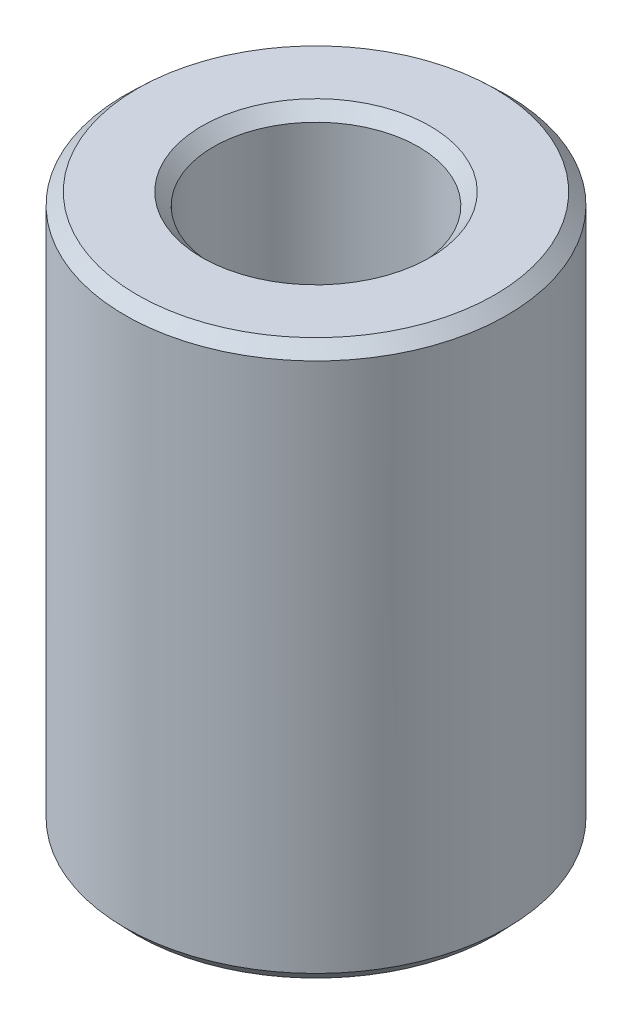
ISO-10303-21;
HEADER;
FILE_DESCRIPTION(('STEP AP214'),'2;1');
FILE_NAME('part.step','',(''),(''),'','','');
FILE_SCHEMA(('AUTOMOTIVE_DESIGN { 1 0 10303 214 1 1 1 1 }'));
ENDSEC;
DATA;
#1=APPLICATION_CONTEXT('core data for automotive mechanical design processes');
#2=APPLICATION_PROTOCOL_DEFINITION('international standard','automotive_design',2000,#1);
#3=PRODUCT_CONTEXT('',#1,'mechanical');
#4=PRODUCT('Part','Part','',(#3));
#5=PRODUCT_RELATED_PRODUCT_CATEGORY('part','',(#4));
#6=PRODUCT_DEFINITION_FORMATION('','',#4);
#7=PRODUCT_DEFINITION_CONTEXT('part definition',#1,'design');
#8=PRODUCT_DEFINITION('design','',#6,#7);
#9=PRODUCT_DEFINITION_SHAPE('','',#8);
#10=(LENGTH_UNIT() NAMED_UNIT(*) SI_UNIT(.MILLI.,.METRE.));
#11=(NAMED_UNIT(*) PLANE_ANGLE_UNIT() SI_UNIT($,.RADIAN.));
#12=(NAMED_UNIT(*) SI_UNIT($,.STERADIAN.) SOLID_ANGLE_UNIT());
#13=UNCERTAINTY_MEASURE_WITH_UNIT(LENGTH_MEASURE(1.E-05),#10,'distance_accuracy_value','');
#14=(GEOMETRIC_REPRESENTATION_CONTEXT(3) GLOBAL_UNCERTAINTY_ASSIGNED_CONTEXT((#13)) GLOBAL_UNIT_ASSIGNED_CONTEXT((#10,
#11,#12)) REPRESENTATION_CONTEXT('',''));
#15=CARTESIAN_POINT('',(0.,0.,0.));
#16=DIRECTION('',(0.,0.,1.));
#17=DIRECTION('',(1.,0.,0.));
#18=AXIS2_PLACEMENT_3D('',#15,#16,#17);
#19=CARTESIAN_POINT('',(0.,159.677422281594,0.));
#20=DIRECTION('',(0.,-1.,0.));
#21=DIRECTION('',(0.,0.,-1.));
#22=AXIS2_PLACEMENT_3D('',#19,#20,#21);
#23=CYLINDRICAL_SURFACE('',#22,55.);
#24=CARTESIAN_POINT('',(0.,3.51561170593054,0.));
#25=DIRECTION('',(0.,1.,0.));
#26=DIRECTION('',(0.,0.,1.));
#27=AXIS2_PLACEMENT_3D('',#24,#25,#26);
#28=CIRCLE('',#27,55.);
#29=CARTESIAN_POINT('',(0.,3.51561170593051,-55.));
#30=VERTEX_POINT('',#29);
#31=EDGE_CURVE('E10',#30,#30,#28,.T.);
#32=CARTESIAN_POINT('',(0.,156.344441713557,0.));
#33=DIRECTION('',(0.,1.,0.));
#34=DIRECTION('',(0.,0.,1.));
#35=AXIS2_PLACEMENT_3D('',#32,#33,#34);
#36=CIRCLE('',#35,55.);
#37=CARTESIAN_POINT('',(0.,156.344441713557,-55.));
#38=VERTEX_POINT('',#37);
#39=EDGE_CURVE('E50',#38,#38,#36,.F.);
#40=CARTESIAN_POINT('',(0.,3.51561170593051,-55.));
#41=CARTESIAN_POINT('',(0.,5.10757868517662,-55.));
#42=CARTESIAN_POINT('',(0.,6.69954566442273,-55.));
#43=CARTESIAN_POINT('',(0.,9.88347962291494,-55.));
#44=CARTESIAN_POINT('',(0.,11.475446602161,-55.));
#45=CARTESIAN_POINT('',(0.,14.6593805606533,-55.));
#46=CARTESIAN_POINT('',(0.,16.2513475398994,-55.));
#47=CARTESIAN_POINT('',(0.,19.4352814983916,-55.));
#48=CARTESIAN_POINT('',(0.,21.0272484776377,-55.));
#49=CARTESIAN_POINT('',(0.,24.2111824361299,-55.));
#50=CARTESIAN_POINT('',(0.,25.803149415376,-55.));
#51=CARTESIAN_POINT('',(0.,28.9870833738682,-55.));
#52=CARTESIAN_POINT('',(0.,30.5790503531143,-55.));
#53=CARTESIAN_POINT('',(0.,33.7629843116065,-55.));
#54=CARTESIAN_POINT('',(0.,35.3549512908526,-55.));
#55=CARTESIAN_POINT('',(0.,38.5388852493449,-55.));
#56=CARTESIAN_POINT('',(0.,40.130852228591,-55.));
#57=CARTESIAN_POINT('',(0.,43.3147861870832,-55.));
#58=CARTESIAN_POINT('',(0.,44.9067531663293,-55.));
#59=CARTESIAN_POINT('',(0.,48.0906871248215,-55.));
#60=CARTESIAN_POINT('',(0.,49.6826541040676,-55.));
#61=CARTESIAN_POINT('',(0.,52.8665880625598,-55.));
#62=CARTESIAN_POINT('',(0.,54.4585550418059,-55.));
#63=CARTESIAN_POINT('',(0.,57.6424890002981,-55.));
#64=CARTESIAN_POINT('',(0.,59.2344559795442,-55.));
#65=CARTESIAN_POINT('',(0.,62.4183899380365,-55.));
#66=CARTESIAN_POINT('',(0.,64.0103569172826,-55.));
#67=CARTESIAN_POINT('',(0.,67.1942908757748,-55.));
#68=CARTESIAN_POINT('',(0.,68.7862578550209,-55.));
#69=CARTESIAN_POINT('',(0.,71.9701918135131,-55.));
#70=CARTESIAN_POINT('',(0.,73.5621587927592,-55.));
#71=CARTESIAN_POINT('',(0.,76.7460927512514,-55.));
#72=CARTESIAN_POINT('',(0.,78.3380597304975,-55.));
#73=CARTESIAN_POINT('',(0.,81.5219936889897,-55.));
#74=CARTESIAN_POINT('',(0.,83.1139606682358,-55.));
#75=CARTESIAN_POINT('',(0.,86.297894626728,-55.));
#76=CARTESIAN_POINT('',(0.,87.8898616059742,-55.));
#77=CARTESIAN_POINT('',(0.,91.0737955644664,-55.));
#78=CARTESIAN_POINT('',(0.,92.6657625437125,-55.));
#79=CARTESIAN_POINT('',(0.,95.8496965022047,-55.));
#80=CARTESIAN_POINT('',(0.,97.4416634814508,-55.));
#81=CARTESIAN_POINT('',(0.,100.625597439943,-55.));
#82=CARTESIAN_POINT('',(0.,102.217564419189,-55.));
#83=CARTESIAN_POINT('',(0.,105.401498377681,-55.));
#84=CARTESIAN_POINT('',(0.,106.993465356927,-55.));
#85=CARTESIAN_POINT('',(0.,110.17739931542,-55.));
#86=CARTESIAN_POINT('',(0.,111.769366294666,-55.));
#87=CARTESIAN_POINT('',(0.,114.953300253158,-55.));
#88=CARTESIAN_POINT('',(0.,116.545267232404,-55.));
#89=CARTESIAN_POINT('',(0.,119.729201190896,-55.));
#90=CARTESIAN_POINT('',(0.,121.321168170142,-55.));
#91=CARTESIAN_POINT('',(0.,124.505102128635,-55.));
#92=CARTESIAN_POINT('',(0.,126.097069107881,-55.));
#93=CARTESIAN_POINT('',(0.,129.281003066373,-55.));
#94=CARTESIAN_POINT('',(0.,130.872970045619,-55.));
#95=CARTESIAN_POINT('',(0.,134.056904004111,-55.));
#96=CARTESIAN_POINT('',(0.,135.648870983357,-55.));
#97=CARTESIAN_POINT('',(0.,138.83280494185,-55.));
#98=CARTESIAN_POINT('',(0.,140.424771921096,-55.));
#99=CARTESIAN_POINT('',(0.,143.608705879588,-55.));
#100=CARTESIAN_POINT('',(0.,145.200672858834,-55.));
#101=CARTESIAN_POINT('',(0.,148.384606817326,-55.));
#102=CARTESIAN_POINT('',(0.,149.976573796572,-55.));
#103=CARTESIAN_POINT('',(0.,153.160507755065,-55.));
#104=CARTESIAN_POINT('',(0.,154.752474734311,-55.));
#105=CARTESIAN_POINT('',(0.,156.344441713557,-55.));
#106=B_SPLINE_CURVE_WITH_KNOTS('',3,(#40,#41,#42,#43,#44,#45,#46,#47,#48,#49,#50,#51,#52,#53,
#54,#55,#56,#57,#58,#59,#60,#61,#62,#63,#64,#65,#66,#67,#68,#69,#70,#71,#72,#73,#74,#75,#76,#77,
#78,#79,#80,#81,#82,#83,#84,#85,#86,#87,#88,#89,#90,#91,#92,#93,#94,#95,#96,#97,#98,#99,#100,
#101,#102,#103,#104,#105),.UNSPECIFIED.,.F.,.F.,(4,2,2,2,2,2,2,2,2,2,2,2,2,2,2,2,2,2,2,2,2,2,2,
2,2,2,2,2,2,2,2,2,4),(0.,4.77590093773833,9.55180187547663,14.327702813215,19.1036037509533,
23.8795046886916,28.6554056264299,33.4313065641682,38.2072075019066,42.9831084396449,
47.7590093773832,52.5349103151215,57.3108112528598,62.0867121905981,66.8626131283365,
71.6385140660748,76.4144150038131,81.1903159415514,85.9662168792897,90.7421178170281,
95.5180187547664,100.293919692505,105.069820630243,109.845721567981,114.62162250572,
119.397523443458,124.173424381196,128.949325318935,133.725226256673,138.501127194411,
143.27702813215,148.052929069888,152.828830007626),.UNSPECIFIED.);
#107=EDGE_CURVE('BSEAM39',#30,#38,#106,.T.);
#108=ORIENTED_EDGE('',*,*,#31,.T.);
#109=ORIENTED_EDGE('',*,*,#39,.T.);
#110=ORIENTED_EDGE('',*,*,#107,.T.);
#111=ORIENTED_EDGE('',*,*,#107,.F.);
#112=EDGE_LOOP('',(#108,#110,#109,#111));
#113=FACE_BOUND('',#112,.T.);
#114=ADVANCED_FACE('F39',(#113),#23,.T.);
#115=CARTESIAN_POINT('',(0.,159.677422281594,0.));
#116=DIRECTION('',(0.,1.,0.));
#117=DIRECTION('',(0.,0.,1.));
#118=AXIS2_PLACEMENT_3D('',#115,#116,#117);
#119=PLANE('',#118);
#120=CARTESIAN_POINT('',(0.,159.677422281594,0.));
#121=DIRECTION('',(0.,1.,0.));
#122=DIRECTION('',(0.,0.,1.));
#123=AXIS2_PLACEMENT_3D('',#120,#121,#122);
#124=CIRCLE('',#123,32.8524784510757);
#125=CARTESIAN_POINT('',(0.,159.677422281594,32.8524784510757));
#126=VERTEX_POINT('',#125);
#127=EDGE_CURVE('E58',#126,#126,#124,.F.);
#128=ORIENTED_EDGE('',*,*,#127,.T.);
#129=EDGE_LOOP('',(#128));
#130=FACE_BOUND('',#129,.T.);
#131=CARTESIAN_POINT('',(0.,159.677422281594,0.));
#132=DIRECTION('',(0.,1.,0.));
#133=DIRECTION('',(0.,0.,1.));
#134=AXIS2_PLACEMENT_3D('',#131,#132,#133);
#135=CIRCLE('',#134,51.4843882940697);
#136=CARTESIAN_POINT('',(0.,159.677422281594,-51.4843882940697));
#137=VERTEX_POINT('',#136);
#138=EDGE_CURVE('E61',#137,#137,#135,.T.);
#139=ORIENTED_EDGE('',*,*,#138,.T.);
#140=EDGE_LOOP('',(#139));
#141=FACE_BOUND('',#140,.T.);
#142=ADVANCED_FACE('F88',(#130,#141),#119,.T.);
#143=CARTESIAN_POINT('',(0.,0.,0.));
#144=DIRECTION('',(0.,1.,0.));
#145=DIRECTION('',(0.,0.,1.));
#146=AXIS2_PLACEMENT_3D('',#143,#144,#145);
#147=PLANE('',#146);
#148=CARTESIAN_POINT('',(0.,0.,0.));
#149=DIRECTION('',(0.,1.,0.));
#150=DIRECTION('',(0.,0.,1.));
#151=AXIS2_PLACEMENT_3D('',#148,#149,#150);
#152=CIRCLE('',#151,33.0351095889689);
#153=CARTESIAN_POINT('',(0.,0.,33.0351095889689));
#154=VERTEX_POINT('',#153);
#155=EDGE_CURVE('E51',#154,#154,#152,.T.);
#156=ORIENTED_EDGE('',*,*,#155,.T.);
#157=EDGE_LOOP('',(#156));
#158=FACE_BOUND('',#157,.T.);
#159=CARTESIAN_POINT('',(0.,0.,0.));
#160=DIRECTION('',(0.,1.,0.));
#161=DIRECTION('',(0.,0.,1.));
#162=AXIS2_PLACEMENT_3D('',#159,#160,#161);
#163=CIRCLE('',#162,51.6670194319628);
#164=CARTESIAN_POINT('',(0.,0.,51.6670194319628));
#165=VERTEX_POINT('',#164);
#166=EDGE_CURVE('E54',#165,#165,#163,.F.);
#167=ORIENTED_EDGE('',*,*,#166,.T.);
#168=EDGE_LOOP('',(#167));
#169=FACE_BOUND('',#168,.T.);
#170=ADVANCED_FACE('F83',(#158,#169),#147,.F.);
#171=CARTESIAN_POINT('',(0.,159.677422281594,0.));
#172=DIRECTION('',(0.,-1.,0.));
#173=DIRECTION('',(0.,0.,-1.));
#174=AXIS2_PLACEMENT_3D('',#171,#172,#173);
#175=CYLINDRICAL_SURFACE('',#174,29.5194978830384);
#176=CARTESIAN_POINT('',(0.,156.161810575663,0.));
#177=DIRECTION('',(0.,1.,0.));
#178=DIRECTION('',(0.,0.,1.));
#179=AXIS2_PLACEMENT_3D('',#176,#177,#178);
#180=CIRCLE('',#179,29.5194978830384);
#181=CARTESIAN_POINT('',(0.,156.161810575663,-29.5194978830384));
#182=VERTEX_POINT('',#181);
#183=EDGE_CURVE('E67',#182,#182,#180,.T.);
#184=CARTESIAN_POINT('',(0.,3.33298056803705,0.));
#185=DIRECTION('',(0.,1.,0.));
#186=DIRECTION('',(0.,0.,1.));
#187=AXIS2_PLACEMENT_3D('',#184,#185,#186);
#188=CIRCLE('',#187,29.5194978830384);
#189=CARTESIAN_POINT('',(0.,3.33298056803705,-29.5194978830384));
#190=VERTEX_POINT('',#189);
#191=EDGE_CURVE('E69',#190,#190,#188,.F.);
#192=CARTESIAN_POINT('',(0.,156.161810575663,-29.5194978830384));
#193=CARTESIAN_POINT('',(0.,154.569843596417,-29.5194978830384));
#194=CARTESIAN_POINT('',(0.,152.977876617171,-29.5194978830384));
#195=CARTESIAN_POINT('',(0.,149.793942658679,-29.5194978830384));
#196=CARTESIAN_POINT('',(0.,148.201975679433,-29.5194978830384));
#197=CARTESIAN_POINT('',(0.,145.01804172094,-29.5194978830384));
#198=CARTESIAN_POINT('',(0.,143.426074741694,-29.5194978830384));
#199=CARTESIAN_POINT('',(0.,140.242140783202,-29.5194978830384));
#200=CARTESIAN_POINT('',(0.,138.650173803956,-29.5194978830384));
#201=CARTESIAN_POINT('',(0.,135.466239845464,-29.5194978830384));
#202=CARTESIAN_POINT('',(0.,133.874272866218,-29.5194978830384));
#203=CARTESIAN_POINT('',(0.,130.690338907725,-29.5194978830384));
#204=CARTESIAN_POINT('',(0.,129.098371928479,-29.5194978830384));
#205=CARTESIAN_POINT('',(0.,125.914437969987,-29.5194978830384));
#206=CARTESIAN_POINT('',(0.,124.322470990741,-29.5194978830384));
#207=CARTESIAN_POINT('',(0.,121.138537032249,-29.5194978830384));
#208=CARTESIAN_POINT('',(0.,119.546570053003,-29.5194978830384));
#209=CARTESIAN_POINT('',(0.,116.36263609451,-29.5194978830384));
#210=CARTESIAN_POINT('',(0.,114.770669115264,-29.5194978830384));
#211=CARTESIAN_POINT('',(0.,111.586735156772,-29.5194978830384));
#212=CARTESIAN_POINT('',(0.,109.994768177526,-29.5194978830384));
#213=CARTESIAN_POINT('',(0.,106.810834219034,-29.5194978830384));
#214=CARTESIAN_POINT('',(0.,105.218867239788,-29.5194978830384));
#215=CARTESIAN_POINT('',(0.,102.034933281296,-29.5194978830384));
#216=CARTESIAN_POINT('',(0.,100.442966302049,-29.5194978830384));
#217=CARTESIAN_POINT('',(0.,97.2590323435572,-29.5194978830384));
#218=CARTESIAN_POINT('',(0.,95.6670653643111,-29.5194978830384));
#219=CARTESIAN_POINT('',(0.,92.4831314058189,-29.5194978830384));
#220=CARTESIAN_POINT('',(0.,90.8911644265728,-29.5194978830384));
#221=CARTESIAN_POINT('',(0.,87.7072304680806,-29.5194978830384));
#222=CARTESIAN_POINT('',(0.,86.1152634888345,-29.5194978830384));
#223=CARTESIAN_POINT('',(0.,82.9313295303423,-29.5194978830384));
#224=CARTESIAN_POINT('',(0.,81.3393625510962,-29.5194978830384));
#225=CARTESIAN_POINT('',(0.,78.155428592604,-29.5194978830384));
#226=CARTESIAN_POINT('',(0.,76.5634616133578,-29.5194978830384));
#227=CARTESIAN_POINT('',(0.,73.3795276548657,-29.5194978830384));
#228=CARTESIAN_POINT('',(0.,71.7875606756195,-29.5194978830384));
#229=CARTESIAN_POINT('',(0.,68.6036267171273,-29.5194978830384));
#230=CARTESIAN_POINT('',(0.,67.0116597378812,-29.5194978830384));
#231=CARTESIAN_POINT('',(0.,63.827725779389,-29.5194978830384));
#232=CARTESIAN_POINT('',(0.,62.2357588001429,-29.5194978830384));
#233=CARTESIAN_POINT('',(0.,59.0518248416507,-29.5194978830384));
#234=CARTESIAN_POINT('',(0.,57.4598578624046,-29.5194978830384));
#235=CARTESIAN_POINT('',(0.,54.2759239039124,-29.5194978830384));
#236=CARTESIAN_POINT('',(0.,52.6839569246663,-29.5194978830384));
#237=CARTESIAN_POINT('',(0.,49.5000229661741,-29.5194978830384));
#238=CARTESIAN_POINT('',(0.,47.908055986928,-29.5194978830384));
#239=CARTESIAN_POINT('',(0.,44.7241220284358,-29.5194978830384));
#240=CARTESIAN_POINT('',(0.,43.1321550491897,-29.5194978830384));
#241=CARTESIAN_POINT('',(0.,39.9482210906975,-29.5194978830384));
#242=CARTESIAN_POINT('',(0.,38.3562541114513,-29.5194978830384));
#243=CARTESIAN_POINT('',(0.,35.1723201529591,-29.5194978830384));
#244=CARTESIAN_POINT('',(0.,33.580353173713,-29.5194978830384));
#245=CARTESIAN_POINT('',(0.,30.3964192152208,-29.5194978830384));
#246=CARTESIAN_POINT('',(0.,28.8044522359747,-29.5194978830384));
#247=CARTESIAN_POINT('',(0.,25.6205182774825,-29.5194978830384));
#248=CARTESIAN_POINT('',(0.,24.0285512982364,-29.5194978830384));
#249=CARTESIAN_POINT('',(0.,20.8446173397442,-29.5194978830384));
#250=CARTESIAN_POINT('',(0.,19.2526503604981,-29.5194978830384));
#251=CARTESIAN_POINT('',(0.,16.0687164020059,-29.5194978830384));
#252=CARTESIAN_POINT('',(0.,14.4767494227598,-29.5194978830384));
#253=CARTESIAN_POINT('',(0.,11.2928154642676,-29.5194978830384));
#254=CARTESIAN_POINT('',(0.,9.70084848502146,-29.5194978830384));
#255=CARTESIAN_POINT('',(0.,6.51691452652925,-29.5194978830384));
#256=CARTESIAN_POINT('',(0.,4.92494754728315,-29.5194978830384));
#257=CARTESIAN_POINT('',(0.,3.33298056803705,-29.5194978830384));
#258=B_SPLINE_CURVE_WITH_KNOTS('',3,(#192,#193,#194,#195,#196,#197,#198,#199,#200,#201,#202,
#203,#204,#205,#206,#207,#208,#209,#210,#211,#212,#213,#214,#215,#216,#217,#218,#219,#220,#221,
#222,#223,#224,#225,#226,#227,#228,#229,#230,#231,#232,#233,#234,#235,#236,#237,#238,#239,#240,
#241,#242,#243,#244,#245,#246,#247,#248,#249,#250,#251,#252,#253,#254,#255,#256,#257),
.UNSPECIFIED.,.F.,.F.,(4,2,2,2,2,2,2,2,2,2,2,2,2,2,2,2,2,2,2,2,2,2,2,2,2,2,2,2,2,2,2,2,4),(0.,
4.7759009377383,9.55180187547661,14.3277028132149,19.1036037509532,23.8795046886915,
28.6554056264298,33.4313065641682,38.2072075019065,42.9831084396448,47.7590093773831,
52.5349103151214,57.3108112528598,62.0867121905981,66.8626131283364,71.6385140660747,
76.414415003813,81.1903159415513,85.9662168792896,90.7421178170279,95.5180187547662,
100.293919692505,105.069820630243,109.845721567981,114.62162250572,119.397523443458,
124.173424381196,128.949325318934,133.725226256673,138.501127194411,143.277028132149,
148.052929069888,152.828830007626),.UNSPECIFIED.);
#259=EDGE_CURVE('BSEAM71',#182,#190,#258,.T.);
#260=ORIENTED_EDGE('',*,*,#183,.T.);
#261=ORIENTED_EDGE('',*,*,#191,.T.);
#262=ORIENTED_EDGE('',*,*,#259,.T.);
#263=ORIENTED_EDGE('',*,*,#259,.F.);
#264=EDGE_LOOP('',(#260,#262,#261,#263));
#265=FACE_BOUND('',#264,.T.);
#266=ADVANCED_FACE('F71',(#265),#175,.F.);
#267=CARTESIAN_POINT('',(0.,156.161810575663,0.));
#268=DIRECTION('',(0.,1.,0.));
#269=DIRECTION('',(0.,0.,1.));
#270=AXIS2_PLACEMENT_3D('',#267,#268,#269);
#271=CONICAL_SURFACE('',#270,29.5194978830384,0.758737521654699);
#272=ORIENTED_EDGE('',*,*,#127,.F.);
#273=EDGE_LOOP('',(#272));
#274=FACE_BOUND('',#273,.T.);
#275=ORIENTED_EDGE('',*,*,#183,.F.);
#276=EDGE_LOOP('',(#275));
#277=FACE_BOUND('',#276,.T.);
#278=ADVANCED_FACE('F77',(#274,#277),#271,.F.);
#279=CARTESIAN_POINT('',(0.,0.,0.));
#280=DIRECTION('',(0.,-1.,0.));
#281=DIRECTION('',(0.,0.,-1.));
#282=AXIS2_PLACEMENT_3D('',#279,#280,#281);
#283=CONICAL_SURFACE('',#282,33.0351095889689,0.812058805140193);
#284=ORIENTED_EDGE('',*,*,#191,.F.);
#285=EDGE_LOOP('',(#284));
#286=FACE_BOUND('',#285,.T.);
#287=ORIENTED_EDGE('',*,*,#155,.F.);
#288=EDGE_LOOP('',(#287));
#289=FACE_BOUND('',#288,.T.);
#290=ADVANCED_FACE('F73',(#286,#289),#283,.F.);
#291=CARTESIAN_POINT('',(0.,3.51561170593054,0.));
#292=DIRECTION('',(0.,1.,0.));
#293=DIRECTION('',(0.,0.,1.));
#294=AXIS2_PLACEMENT_3D('',#291,#292,#293);
#295=CONICAL_SURFACE('',#294,55.,0.758737521654705);
#296=ORIENTED_EDGE('',*,*,#166,.F.);
#297=EDGE_LOOP('',(#296));
#298=FACE_BOUND('',#297,.T.);
#299=ORIENTED_EDGE('',*,*,#31,.F.);
#300=EDGE_LOOP('',(#299));
#301=FACE_BOUND('',#300,.T.);
#302=ADVANCED_FACE('F76',(#298,#301),#295,.T.);
#303=CARTESIAN_POINT('',(0.,159.677422281594,0.));
#304=DIRECTION('',(0.,-1.,0.));
#305=DIRECTION('',(0.,0.,-1.));
#306=AXIS2_PLACEMENT_3D('',#303,#304,#305);
#307=CONICAL_SURFACE('',#306,51.4843882940697,0.812058805140188);
#308=CARTESIAN_POINT('',(0.,156.344441713557,-55.));
#309=CARTESIAN_POINT('',(0.,156.37916026114,-54.9633790447299));
#310=CARTESIAN_POINT('',(0.,156.413878808724,-54.9267580894598));
#311=CARTESIAN_POINT('',(0.,156.483315903892,-54.8535161789196));
#312=CARTESIAN_POINT('',(0.,156.518034451475,-54.8168952236495));
#313=CARTESIAN_POINT('',(0.,156.587471546643,-54.7436533131093));
#314=CARTESIAN_POINT('',(0.,156.622190094226,-54.7070323578392));
#315=CARTESIAN_POINT('',(0.,156.691627189394,-54.6337904472989));
#316=CARTESIAN_POINT('',(0.,156.726345736978,-54.5971694920288));
#317=CARTESIAN_POINT('',(0.,156.795782832145,-54.5239275814886));
#318=CARTESIAN_POINT('',(0.,156.830501379729,-54.4873066262185));
#319=CARTESIAN_POINT('',(0.,156.899938474896,-54.4140647156783));
#320=CARTESIAN_POINT('',(0.,156.93465702248,-54.3774437604082));
#321=CARTESIAN_POINT('',(0.,157.004094117647,-54.304201849868));
#322=CARTESIAN_POINT('',(0.,157.038812665231,-54.2675808945979));
#323=CARTESIAN_POINT('',(0.,157.108249760399,-54.1943389840577));
#324=CARTESIAN_POINT('',(0.,157.142968307982,-54.1577180287875));
#325=CARTESIAN_POINT('',(0.,157.21240540315,-54.0844761182473));
#326=CARTESIAN_POINT('',(0.,157.247123950733,-54.0478551629772));
#327=CARTESIAN_POINT('',(0.,157.316561045901,-53.974613252437));
#328=CARTESIAN_POINT('',(0.,157.351279593485,-53.9379922971669));
#329=CARTESIAN_POINT('',(0.,157.420716688652,-53.8647503866267));
#330=CARTESIAN_POINT('',(0.,157.455435236236,-53.8281294313566));
#331=CARTESIAN_POINT('',(0.,157.524872331403,-53.7548875208164));
#332=CARTESIAN_POINT('',(0.,157.559590878987,-53.7182665655463));
#333=CARTESIAN_POINT('',(0.,157.629027974154,-53.645024655006));
#334=CARTESIAN_POINT('',(0.,157.663746521738,-53.6084036997359));
#335=CARTESIAN_POINT('',(0.,157.733183616905,-53.5351617891957));
#336=CARTESIAN_POINT('',(0.,157.767902164489,-53.4985408339256));
#337=CARTESIAN_POINT('',(0.,157.837339259657,-53.4252989233854));
#338=CARTESIAN_POINT('',(0.,157.87205780724,-53.3886779681153));
#339=CARTESIAN_POINT('',(0.,157.941494902408,-53.3154360575751));
#340=CARTESIAN_POINT('',(0.,157.976213449992,-53.278815102305));
#341=CARTESIAN_POINT('',(0.,158.045650545159,-53.2055731917647));
#342=CARTESIAN_POINT('',(0.,158.080369092743,-53.1689522364946));
#343=CARTESIAN_POINT('',(0.,158.14980618791,-53.0957103259544));
#344=CARTESIAN_POINT('',(0.,158.184524735494,-53.0590893706843));
#345=CARTESIAN_POINT('',(0.,158.253961830661,-52.9858474601441));
#346=CARTESIAN_POINT('',(0.,158.288680378245,-52.949226504874));
#347=CARTESIAN_POINT('',(0.,158.358117473412,-52.8759845943338));
#348=CARTESIAN_POINT('',(0.,158.392836020996,-52.8393636390637));
#349=CARTESIAN_POINT('',(0.,158.462273116164,-52.7661217285235));
#350=CARTESIAN_POINT('',(0.,158.496991663747,-52.7295007732533));
#351=CARTESIAN_POINT('',(0.,158.566428758915,-52.6562588627131));
#352=CARTESIAN_POINT('',(0.,158.601147306498,-52.619637907443));
#353=CARTESIAN_POINT('',(0.,158.670584401666,-52.5463959969028));
#354=CARTESIAN_POINT('',(0.,158.70530294925,-52.5097750416327));
#355=CARTESIAN_POINT('',(0.,158.774740044417,-52.4365331310925));
#356=CARTESIAN_POINT('',(0.,158.809458592001,-52.3999121758224));
#357=CARTESIAN_POINT('',(0.,158.878895687168,-52.3266702652822));
#358=CARTESIAN_POINT('',(0.,158.913614234752,-52.2900493100121));
#359=CARTESIAN_POINT('',(0.,158.983051329919,-52.2168073994718));
#360=CARTESIAN_POINT('',(0.,159.017769877503,-52.1801864442017));
#361=CARTESIAN_POINT('',(0.,159.087206972671,-52.1069445336615));
#362=CARTESIAN_POINT('',(0.,159.121925520254,-52.0703235783914));
#363=CARTESIAN_POINT('',(0.,159.191362615422,-51.9970816678512));
#364=CARTESIAN_POINT('',(0.,159.226081163005,-51.9604607125811));
#365=CARTESIAN_POINT('',(0.,159.295518258173,-51.8872188020409));
#366=CARTESIAN_POINT('',(0.,159.330236805757,-51.8505978467708));
#367=CARTESIAN_POINT('',(0.,159.399673900924,-51.7773559362305));
#368=CARTESIAN_POINT('',(0.,159.434392448508,-51.7407349809604));
#369=CARTESIAN_POINT('',(0.,159.503829543675,-51.6674930704202));
#370=CARTESIAN_POINT('',(0.,159.538548091259,-51.6308721151501));
#371=CARTESIAN_POINT('',(0.,159.607985186426,-51.5576302046099));
#372=CARTESIAN_POINT('',(0.,159.64270373401,-51.5210092493398));
#373=CARTESIAN_POINT('',(0.,159.677422281594,-51.4843882940697));
#374=B_SPLINE_CURVE_WITH_KNOTS('',3,(#308,#309,#310,#311,#312,#313,#314,#315,#316,#317,#318,
#319,#320,#321,#322,#323,#324,#325,#326,#327,#328,#329,#330,#331,#332,#333,#334,#335,#336,#337,
#338,#339,#340,#341,#342,#343,#344,#345,#346,#347,#348,#349,#350,#351,#352,#353,#354,#355,#356,
#357,#358,#359,#360,#361,#362,#363,#364,#365,#366,#367,#368,#369,#370,#371,#372,#373),
.UNSPECIFIED.,.F.,.F.,(4,2,2,2,2,2,2,2,2,2,2,2,2,2,2,2,2,2,2,2,2,2,2,2,2,2,2,2,2,2,2,2,4),(0.,
0.151387737947835,0.30277547589567,0.454163213843506,0.605550951791346,0.756938689739181,
0.908326427687016,1.05971416563485,1.21110190358271,1.36248964153055,1.51387737947838,
1.66526511742622,1.81665285537405,1.96804059332189,2.11942833126973,2.27081606921756,
2.42220380716542,2.57359154511325,2.72497928306109,2.87636702100892,3.02775475895676,
3.1791424969046,3.33053023485243,3.48191797280027,3.63330571074812,3.78469344869596,
3.9360811866438,4.08746892459163,4.23885666253947,4.3902444004873,4.54163213843514,
4.69301987638298,4.84440761433083),.UNSPECIFIED.);
#375=EDGE_CURVE('BSEAM45',#38,#137,#374,.T.);
#376=ORIENTED_EDGE('',*,*,#39,.F.);
#377=ORIENTED_EDGE('',*,*,#138,.F.);
#378=ORIENTED_EDGE('',*,*,#375,.T.);
#379=ORIENTED_EDGE('',*,*,#375,.F.);
#380=EDGE_LOOP('',(#376,#378,#377,#379));
#381=FACE_BOUND('',#380,.T.);
#382=ADVANCED_FACE('F45',(#381),#307,.T.);
#383=CLOSED_SHELL('',(#114,#142,#170,#266,#278,#290,#302,#382));
#384=MANIFOLD_SOLID_BREP('B2',#383);
#385=ADVANCED_BREP_SHAPE_REPRESENTATION('',(#18,#384),#14);
#386=SHAPE_DEFINITION_REPRESENTATION(#9,#385);
ENDSEC;
END-ISO-10303-21;
